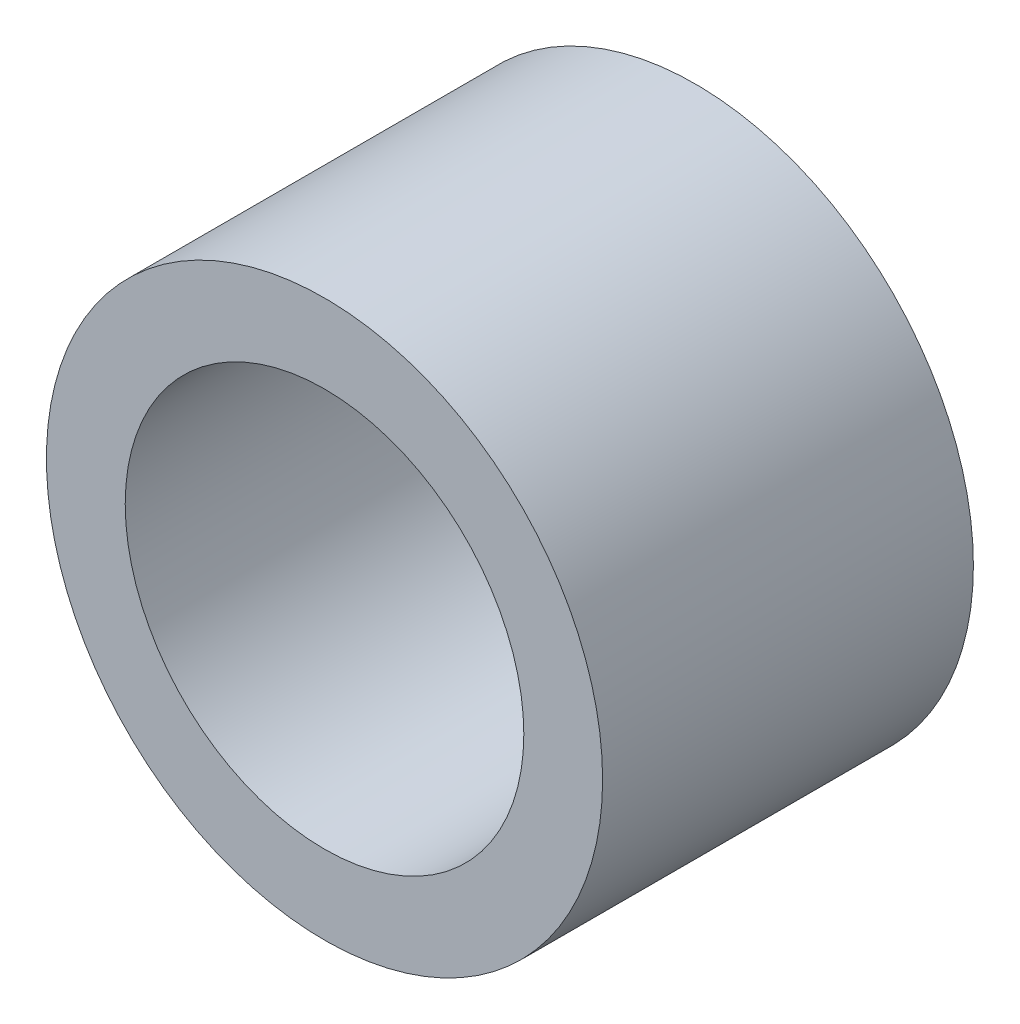
ISO-10303-21;
HEADER;
FILE_DESCRIPTION(('STEP AP214'),'2;1');
FILE_NAME('part.step','',(''),(''),'','','');
FILE_SCHEMA(('AUTOMOTIVE_DESIGN { 1 0 10303 214 1 1 1 1 }'));
ENDSEC;
DATA;
#1=APPLICATION_CONTEXT('core data for automotive mechanical design processes');
#2=APPLICATION_PROTOCOL_DEFINITION('international standard','automotive_design',2000,#1);
#3=PRODUCT_CONTEXT('',#1,'mechanical');
#4=PRODUCT('Part','Part','',(#3));
#5=PRODUCT_RELATED_PRODUCT_CATEGORY('part','',(#4));
#6=PRODUCT_DEFINITION_FORMATION('','',#4);
#7=PRODUCT_DEFINITION_CONTEXT('part definition',#1,'design');
#8=PRODUCT_DEFINITION('design','',#6,#7);
#9=PRODUCT_DEFINITION_SHAPE('','',#8);
#10=(LENGTH_UNIT() NAMED_UNIT(*) SI_UNIT(.MILLI.,.METRE.));
#11=(NAMED_UNIT(*) PLANE_ANGLE_UNIT() SI_UNIT($,.RADIAN.));
#12=(NAMED_UNIT(*) SI_UNIT($,.STERADIAN.) SOLID_ANGLE_UNIT());
#13=UNCERTAINTY_MEASURE_WITH_UNIT(LENGTH_MEASURE(1.E-05),#10,'distance_accuracy_value','');
#14=(GEOMETRIC_REPRESENTATION_CONTEXT(3) GLOBAL_UNCERTAINTY_ASSIGNED_CONTEXT((#13)) GLOBAL_UNIT_ASSIGNED_CONTEXT((#10,
#11,#12)) REPRESENTATION_CONTEXT('',''));
#15=CARTESIAN_POINT('',(0.,0.,0.));
#16=DIRECTION('',(0.,0.,1.));
#17=DIRECTION('',(1.,0.,0.));
#18=AXIS2_PLACEMENT_3D('',#15,#16,#17);
#19=CARTESIAN_POINT('',(0.,0.,4.));
#20=DIRECTION('',(0.,0.,1.));
#21=DIRECTION('',(1.,0.,0.));
#22=AXIS2_PLACEMENT_3D('',#19,#20,#21);
#23=PLANE('',#22);
#24=CARTESIAN_POINT('',(0.,0.,4.));
#25=DIRECTION('',(0.,0.,1.));
#26=DIRECTION('',(1.,0.,0.));
#27=AXIS2_PLACEMENT_3D('',#24,#25,#26);
#28=CIRCLE('',#27,3.);
#29=CARTESIAN_POINT('',(3.,0.,4.));
#30=VERTEX_POINT('',#29);
#31=EDGE_CURVE('E10',#30,#30,#28,.T.);
#32=ORIENTED_EDGE('',*,*,#31,.T.);
#33=EDGE_LOOP('',(#32));
#34=FACE_BOUND('',#33,.T.);
#35=CARTESIAN_POINT('',(0.,0.,4.));
#36=DIRECTION('',(0.,0.,1.));
#37=DIRECTION('',(1.,0.,0.));
#38=AXIS2_PLACEMENT_3D('',#35,#36,#37);
#39=CIRCLE('',#38,2.15);
#40=CARTESIAN_POINT('',(2.15,0.,4.));
#41=VERTEX_POINT('',#40);
#42=EDGE_CURVE('E56',#41,#41,#39,.T.);
#43=ORIENTED_EDGE('',*,*,#42,.F.);
#44=EDGE_LOOP('',(#43));
#45=FACE_BOUND('',#44,.T.);
#46=ADVANCED_FACE('F43',(#34,#45),#23,.T.);
#47=CARTESIAN_POINT('',(0.,0.,0.));
#48=DIRECTION('',(0.,0.,1.));
#49=DIRECTION('',(1.,0.,0.));
#50=AXIS2_PLACEMENT_3D('',#47,#48,#49);
#51=PLANE('',#50);
#52=CARTESIAN_POINT('',(0.,0.,0.));
#53=DIRECTION('',(0.,0.,1.));
#54=DIRECTION('',(1.,0.,0.));
#55=AXIS2_PLACEMENT_3D('',#52,#53,#54);
#56=CIRCLE('',#55,3.);
#57=CARTESIAN_POINT('',(3.,0.,0.));
#58=VERTEX_POINT('',#57);
#59=EDGE_CURVE('E47',#58,#58,#56,.T.);
#60=ORIENTED_EDGE('',*,*,#59,.F.);
#61=EDGE_LOOP('',(#60));
#62=FACE_BOUND('',#61,.T.);
#63=CARTESIAN_POINT('',(0.,0.,0.));
#64=DIRECTION('',(0.,0.,1.));
#65=DIRECTION('',(1.,0.,0.));
#66=AXIS2_PLACEMENT_3D('',#63,#64,#65);
#67=CIRCLE('',#66,2.15);
#68=CARTESIAN_POINT('',(2.15,0.,0.));
#69=VERTEX_POINT('',#68);
#70=EDGE_CURVE('E58',#69,#69,#67,.T.);
#71=ORIENTED_EDGE('',*,*,#70,.T.);
#72=EDGE_LOOP('',(#71));
#73=FACE_BOUND('',#72,.T.);
#74=ADVANCED_FACE('F70',(#62,#73),#51,.F.);
#75=CARTESIAN_POINT('',(0.,0.,4.));
#76=DIRECTION('',(0.,0.,-1.));
#77=DIRECTION('',(-1.,0.,0.));
#78=AXIS2_PLACEMENT_3D('',#75,#76,#77);
#79=CYLINDRICAL_SURFACE('',#78,3.);
#80=ORIENTED_EDGE('',*,*,#31,.F.);
#81=EDGE_LOOP('',(#80));
#82=FACE_BOUND('',#81,.T.);
#83=ORIENTED_EDGE('',*,*,#59,.T.);
#84=EDGE_LOOP('',(#83));
#85=FACE_BOUND('',#84,.T.);
#86=ADVANCED_FACE('F45',(#82,#85),#79,.T.);
#87=CARTESIAN_POINT('',(0.,0.,4.));
#88=DIRECTION('',(0.,0.,-1.));
#89=DIRECTION('',(-1.,0.,0.));
#90=AXIS2_PLACEMENT_3D('',#87,#88,#89);
#91=CYLINDRICAL_SURFACE('',#90,2.15);
#92=ORIENTED_EDGE('',*,*,#42,.T.);
#93=EDGE_LOOP('',(#92));
#94=FACE_BOUND('',#93,.T.);
#95=ORIENTED_EDGE('',*,*,#70,.F.);
#96=EDGE_LOOP('',(#95));
#97=FACE_BOUND('',#96,.T.);
#98=ADVANCED_FACE('F66',(#94,#97),#91,.F.);
#99=CLOSED_SHELL('',(#46,#74,#86,#98));
#100=MANIFOLD_SOLID_BREP('B2',#99);
#101=ADVANCED_BREP_SHAPE_REPRESENTATION('',(#18,#100),#14);
#102=SHAPE_DEFINITION_REPRESENTATION(#9,#101);
ENDSEC;
END-ISO-10303-21;
